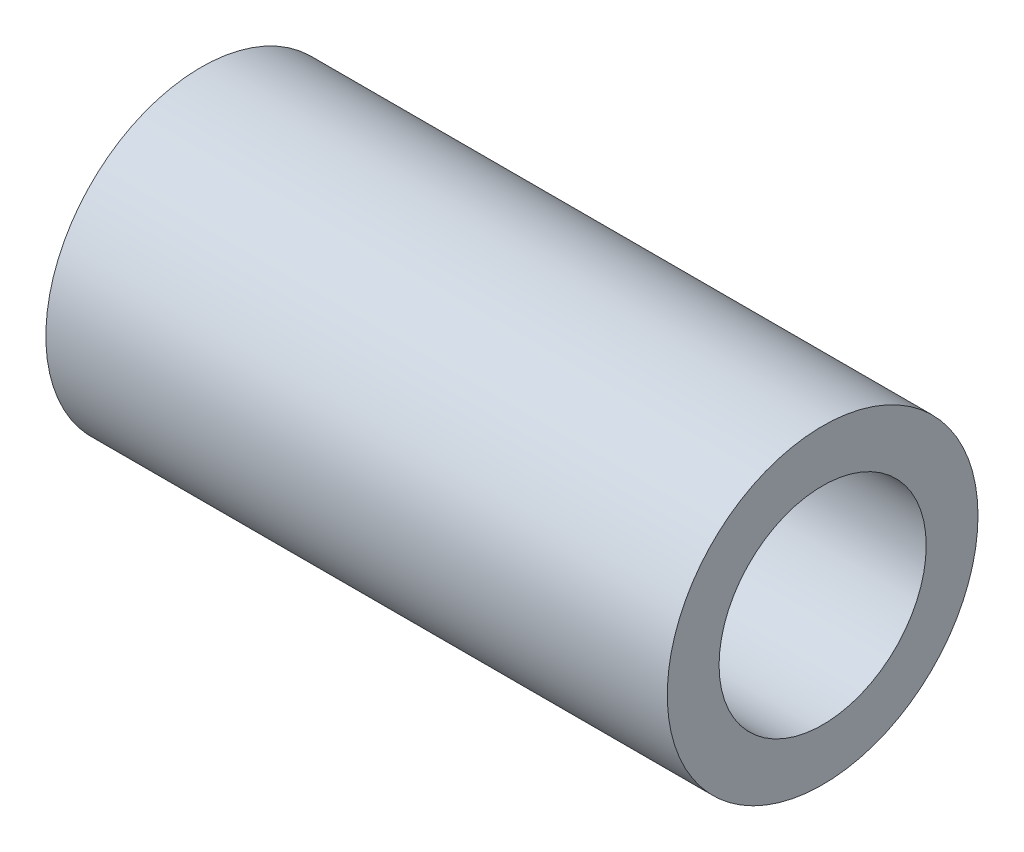
ISO-10303-21;
HEADER;
FILE_DESCRIPTION(('STEP AP214'),'2;1');
FILE_NAME('part.step','',(''),(''),'','','');
FILE_SCHEMA(('AUTOMOTIVE_DESIGN { 1 0 10303 214 1 1 1 1 }'));
ENDSEC;
DATA;
#1=APPLICATION_CONTEXT('core data for automotive mechanical design processes');
#2=APPLICATION_PROTOCOL_DEFINITION('international standard','automotive_design',2000,#1);
#3=PRODUCT_CONTEXT('',#1,'mechanical');
#4=PRODUCT('Part','Part','',(#3));
#5=PRODUCT_RELATED_PRODUCT_CATEGORY('part','',(#4));
#6=PRODUCT_DEFINITION_FORMATION('','',#4);
#7=PRODUCT_DEFINITION_CONTEXT('part definition',#1,'design');
#8=PRODUCT_DEFINITION('design','',#6,#7);
#9=PRODUCT_DEFINITION_SHAPE('','',#8);
#10=(LENGTH_UNIT() NAMED_UNIT(*) SI_UNIT(.MILLI.,.METRE.));
#11=(NAMED_UNIT(*) PLANE_ANGLE_UNIT() SI_UNIT($,.RADIAN.));
#12=(NAMED_UNIT(*) SI_UNIT($,.STERADIAN.) SOLID_ANGLE_UNIT());
#13=UNCERTAINTY_MEASURE_WITH_UNIT(LENGTH_MEASURE(1.E-05),#10,'distance_accuracy_value','');
#14=(GEOMETRIC_REPRESENTATION_CONTEXT(3) GLOBAL_UNCERTAINTY_ASSIGNED_CONTEXT((#13)) GLOBAL_UNIT_ASSIGNED_CONTEXT((#10,
#11,#12)) REPRESENTATION_CONTEXT('',''));
#15=CARTESIAN_POINT('',(0.,0.,0.));
#16=DIRECTION('',(0.,0.,1.));
#17=DIRECTION('',(1.,0.,0.));
#18=AXIS2_PLACEMENT_3D('',#15,#16,#17);
#19=CARTESIAN_POINT('',(9.525,0.,0.));
#20=DIRECTION('',(1.,0.,0.));
#21=DIRECTION('',(0.,0.,-1.));
#22=AXIS2_PLACEMENT_3D('',#19,#20,#21);
#23=PLANE('',#22);
#24=CARTESIAN_POINT('',(9.525,0.,0.));
#25=DIRECTION('',(1.,0.,0.));
#26=DIRECTION('',(0.,0.,-1.));
#27=AXIS2_PLACEMENT_3D('',#24,#25,#26);
#28=CIRCLE('',#27,4.7625);
#29=CARTESIAN_POINT('',(9.525,0.,-4.7625));
#30=VERTEX_POINT('',#29);
#31=EDGE_CURVE('E10',#30,#30,#28,.T.);
#32=ORIENTED_EDGE('',*,*,#31,.T.);
#33=EDGE_LOOP('',(#32));
#34=FACE_BOUND('',#33,.T.);
#35=CARTESIAN_POINT('',(9.525,0.,0.));
#36=DIRECTION('',(1.,0.,0.));
#37=DIRECTION('',(0.,0.,-1.));
#38=AXIS2_PLACEMENT_3D('',#35,#36,#37);
#39=CIRCLE('',#38,3.175);
#40=CARTESIAN_POINT('',(9.525,0.,-3.175));
#41=VERTEX_POINT('',#40);
#42=EDGE_CURVE('E365',#41,#41,#39,.T.);
#43=ORIENTED_EDGE('',*,*,#42,.F.);
#44=EDGE_LOOP('',(#43));
#45=FACE_BOUND('',#44,.T.);
#46=ADVANCED_FACE('F358',(#34,#45),#23,.T.);
#47=CARTESIAN_POINT('',(9.525,0.,0.));
#48=DIRECTION('',(-1.,0.,0.));
#49=DIRECTION('',(0.,0.,1.));
#50=AXIS2_PLACEMENT_3D('',#47,#48,#49);
#51=CYLINDRICAL_SURFACE('',#50,4.7625);
#52=ORIENTED_EDGE('',*,*,#31,.F.);
#53=EDGE_LOOP('',(#52));
#54=FACE_BOUND('',#53,.T.);
#55=CARTESIAN_POINT('',(-9.525,0.,0.));
#56=DIRECTION('',(1.,0.,0.));
#57=DIRECTION('',(0.,0.,-1.));
#58=AXIS2_PLACEMENT_3D('',#55,#56,#57);
#59=CIRCLE('',#58,4.7625);
#60=CARTESIAN_POINT('',(-9.525,0.,-4.7625));
#61=VERTEX_POINT('',#60);
#62=EDGE_CURVE('E369',#61,#61,#59,.T.);
#63=ORIENTED_EDGE('',*,*,#62,.T.);
#64=EDGE_LOOP('',(#63));
#65=FACE_BOUND('',#64,.T.);
#66=ADVANCED_FACE('F360',(#54,#65),#51,.T.);
#67=CARTESIAN_POINT('',(9.525,0.,0.));
#68=DIRECTION('',(-1.,0.,0.));
#69=DIRECTION('',(0.,0.,1.));
#70=AXIS2_PLACEMENT_3D('',#67,#68,#69);
#71=CYLINDRICAL_SURFACE('',#70,3.175);
#72=ORIENTED_EDGE('',*,*,#42,.T.);
#73=EDGE_LOOP('',(#72));
#74=FACE_BOUND('',#73,.T.);
#75=CARTESIAN_POINT('',(-9.525,0.,0.));
#76=DIRECTION('',(1.,0.,0.));
#77=DIRECTION('',(0.,0.,-1.));
#78=AXIS2_PLACEMENT_3D('',#75,#76,#77);
#79=CIRCLE('',#78,3.175);
#80=CARTESIAN_POINT('',(-9.525,0.,-3.175));
#81=VERTEX_POINT('',#80);
#82=EDGE_CURVE('E373',#81,#81,#79,.T.);
#83=ORIENTED_EDGE('',*,*,#82,.F.);
#84=EDGE_LOOP('',(#83));
#85=FACE_BOUND('',#84,.T.);
#86=ADVANCED_FACE('F382',(#74,#85),#71,.F.);
#87=CARTESIAN_POINT('',(-9.525,0.,0.));
#88=DIRECTION('',(1.,0.,0.));
#89=DIRECTION('',(0.,0.,-1.));
#90=AXIS2_PLACEMENT_3D('',#87,#88,#89);
#91=PLANE('',#90);
#92=ORIENTED_EDGE('',*,*,#82,.T.);
#93=EDGE_LOOP('',(#92));
#94=FACE_BOUND('',#93,.T.);
#95=ORIENTED_EDGE('',*,*,#62,.F.);
#96=EDGE_LOOP('',(#95));
#97=FACE_BOUND('',#96,.T.);
#98=ADVANCED_FACE('F379',(#94,#97),#91,.F.);
#99=CLOSED_SHELL('',(#46,#66,#86,#98));
#100=MANIFOLD_SOLID_BREP('B2',#99);
#101=ADVANCED_BREP_SHAPE_REPRESENTATION('',(#18,#100),#14);
#102=SHAPE_DEFINITION_REPRESENTATION(#9,#101);
ENDSEC;
END-ISO-10303-21;
